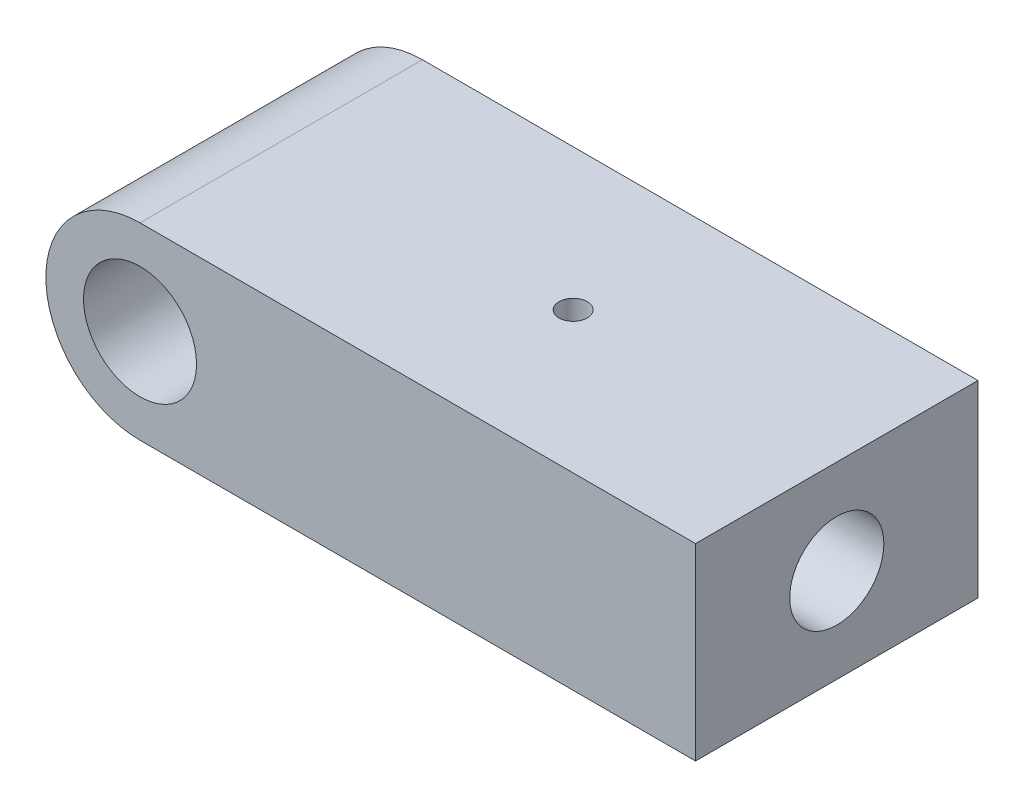
ISO-10303-21;
HEADER;
FILE_DESCRIPTION(('STEP AP214'),'2;1');
FILE_NAME('part.step','',(''),(''),'','','');
FILE_SCHEMA(('AUTOMOTIVE_DESIGN { 1 0 10303 214 1 1 1 1 }'));
ENDSEC;
DATA;
#1=APPLICATION_CONTEXT('core data for automotive mechanical design processes');
#2=APPLICATION_PROTOCOL_DEFINITION('international standard','automotive_design',2000,#1);
#3=PRODUCT_CONTEXT('',#1,'mechanical');
#4=PRODUCT('Part','Part','',(#3));
#5=PRODUCT_RELATED_PRODUCT_CATEGORY('part','',(#4));
#6=PRODUCT_DEFINITION_FORMATION('','',#4);
#7=PRODUCT_DEFINITION_CONTEXT('part definition',#1,'design');
#8=PRODUCT_DEFINITION('design','',#6,#7);
#9=PRODUCT_DEFINITION_SHAPE('','',#8);
#10=(LENGTH_UNIT() NAMED_UNIT(*) SI_UNIT(.MILLI.,.METRE.));
#11=(NAMED_UNIT(*) PLANE_ANGLE_UNIT() SI_UNIT($,.RADIAN.));
#12=(NAMED_UNIT(*) SI_UNIT($,.STERADIAN.) SOLID_ANGLE_UNIT());
#13=UNCERTAINTY_MEASURE_WITH_UNIT(LENGTH_MEASURE(1.E-05),#10,'distance_accuracy_value','');
#14=(GEOMETRIC_REPRESENTATION_CONTEXT(3) GLOBAL_UNCERTAINTY_ASSIGNED_CONTEXT((#13)) GLOBAL_UNIT_ASSIGNED_CONTEXT((#10,
#11,#12)) REPRESENTATION_CONTEXT('',''));
#15=CARTESIAN_POINT('',(0.,0.,0.));
#16=DIRECTION('',(0.,0.,1.));
#17=DIRECTION('',(1.,0.,0.));
#18=AXIS2_PLACEMENT_3D('',#15,#16,#17);
#19=CARTESIAN_POINT('',(0.,0.,15.));
#20=DIRECTION('',(0.,0.,1.));
#21=DIRECTION('',(1.,0.,0.));
#22=AXIS2_PLACEMENT_3D('',#19,#20,#21);
#23=PLANE('',#22);
#24=CARTESIAN_POINT('',(0.,0.,15.));
#25=DIRECTION('',(0.,0.,1.));
#26=DIRECTION('',(1.,0.,0.));
#27=AXIS2_PLACEMENT_3D('',#24,#25,#26);
#28=CIRCLE('',#27,10.);
#29=CARTESIAN_POINT('',(0.,10.,15.));
#30=VERTEX_POINT('',#29);
#31=CARTESIAN_POINT('',(0.,-10.,15.));
#32=VERTEX_POINT('',#31);
#33=EDGE_CURVE('E122',#30,#32,#28,.T.);
#34=ORIENTED_EDGE('',*,*,#33,.T.);
#35=DIRECTION('',(1.,0.,0.));
#36=VECTOR('',#35,1.);
#37=CARTESIAN_POINT('',(0.,-10.,15.));
#38=LINE('',#37,#36);
#39=CARTESIAN_POINT('',(59.,-10.,15.));
#40=VERTEX_POINT('',#39);
#41=EDGE_CURVE('E94',#32,#40,#38,.T.);
#42=ORIENTED_EDGE('',*,*,#41,.T.);
#43=DIRECTION('',(0.,1.,0.));
#44=VECTOR('',#43,1.);
#45=CARTESIAN_POINT('',(59.,10.,15.));
#46=LINE('',#45,#44);
#47=CARTESIAN_POINT('',(59.,10.,15.));
#48=VERTEX_POINT('',#47);
#49=EDGE_CURVE('E125',#40,#48,#46,.T.);
#50=ORIENTED_EDGE('',*,*,#49,.T.);
#51=DIRECTION('',(-1.,0.,0.));
#52=VECTOR('',#51,1.);
#53=CARTESIAN_POINT('',(0.,10.,15.));
#54=LINE('',#53,#52);
#55=EDGE_CURVE('E63',#48,#30,#54,.T.);
#56=ORIENTED_EDGE('',*,*,#55,.T.);
#57=EDGE_LOOP('',(#34,#42,#50,#56));
#58=FACE_BOUND('',#57,.T.);
#59=CARTESIAN_POINT('',(0.,0.,15.));
#60=DIRECTION('',(0.,0.,1.));
#61=DIRECTION('',(1.,0.,0.));
#62=AXIS2_PLACEMENT_3D('',#59,#60,#61);
#63=CIRCLE('',#62,6.);
#64=CARTESIAN_POINT('',(6.,0.,15.));
#65=VERTEX_POINT('',#64);
#66=EDGE_CURVE('E112',#65,#65,#63,.T.);
#67=ORIENTED_EDGE('',*,*,#66,.F.);
#68=EDGE_LOOP('',(#67));
#69=FACE_BOUND('',#68,.T.);
#70=ADVANCED_FACE('F40',(#58,#69),#23,.T.);
#71=CARTESIAN_POINT('',(0.,0.,-15.));
#72=DIRECTION('',(0.,0.,1.));
#73=DIRECTION('',(1.,0.,0.));
#74=AXIS2_PLACEMENT_3D('',#71,#72,#73);
#75=PLANE('',#74);
#76=CARTESIAN_POINT('',(0.,0.,-15.));
#77=DIRECTION('',(0.,0.,1.));
#78=DIRECTION('',(1.,0.,0.));
#79=AXIS2_PLACEMENT_3D('',#76,#77,#78);
#80=CIRCLE('',#79,10.);
#81=CARTESIAN_POINT('',(0.,10.,-15.));
#82=VERTEX_POINT('',#81);
#83=CARTESIAN_POINT('',(0.,-10.,-15.));
#84=VERTEX_POINT('',#83);
#85=EDGE_CURVE('E120',#82,#84,#80,.T.);
#86=ORIENTED_EDGE('',*,*,#85,.F.);
#87=DIRECTION('',(-1.,0.,0.));
#88=VECTOR('',#87,1.);
#89=CARTESIAN_POINT('',(0.,10.,-15.));
#90=LINE('',#89,#88);
#91=CARTESIAN_POINT('',(59.,10.,-15.));
#92=VERTEX_POINT('',#91);
#93=EDGE_CURVE('E87',#92,#82,#90,.T.);
#94=ORIENTED_EDGE('',*,*,#93,.F.);
#95=DIRECTION('',(0.,1.,0.));
#96=VECTOR('',#95,1.);
#97=CARTESIAN_POINT('',(59.,10.,-15.));
#98=LINE('',#97,#96);
#99=CARTESIAN_POINT('',(59.,-10.,-15.));
#100=VERTEX_POINT('',#99);
#101=EDGE_CURVE('E81',#100,#92,#98,.T.);
#102=ORIENTED_EDGE('',*,*,#101,.F.);
#103=DIRECTION('',(1.,0.,0.));
#104=VECTOR('',#103,1.);
#105=CARTESIAN_POINT('',(0.,-10.,-15.));
#106=LINE('',#105,#104);
#107=EDGE_CURVE('E131',#84,#100,#106,.T.);
#108=ORIENTED_EDGE('',*,*,#107,.F.);
#109=EDGE_LOOP('',(#86,#94,#102,#108));
#110=FACE_BOUND('',#109,.T.);
#111=CARTESIAN_POINT('',(0.,0.,-15.));
#112=DIRECTION('',(0.,0.,1.));
#113=DIRECTION('',(1.,0.,0.));
#114=AXIS2_PLACEMENT_3D('',#111,#112,#113);
#115=CIRCLE('',#114,6.);
#116=CARTESIAN_POINT('',(6.,0.,-15.));
#117=VERTEX_POINT('',#116);
#118=EDGE_CURVE('E108',#117,#117,#115,.T.);
#119=ORIENTED_EDGE('',*,*,#118,.T.);
#120=EDGE_LOOP('',(#119));
#121=FACE_BOUND('',#120,.T.);
#122=ADVANCED_FACE('F166',(#110,#121),#75,.F.);
#123=CARTESIAN_POINT('',(0.,0.,15.));
#124=DIRECTION('',(0.,0.,-1.));
#125=DIRECTION('',(-1.,0.,0.));
#126=AXIS2_PLACEMENT_3D('',#123,#124,#125);
#127=CYLINDRICAL_SURFACE('',#126,10.);
#128=ORIENTED_EDGE('',*,*,#85,.T.);
#129=DIRECTION('',(0.,0.,-1.));
#130=VECTOR('',#129,1.);
#131=CARTESIAN_POINT('',(0.,-10.,15.));
#132=LINE('',#131,#130);
#133=EDGE_CURVE('E11',#32,#84,#132,.T.);
#134=ORIENTED_EDGE('',*,*,#133,.F.);
#135=ORIENTED_EDGE('',*,*,#33,.F.);
#136=DIRECTION('',(0.,0.,-1.));
#137=VECTOR('',#136,1.);
#138=CARTESIAN_POINT('',(0.,10.,15.));
#139=LINE('',#138,#137);
#140=EDGE_CURVE('E128',#30,#82,#139,.T.);
#141=ORIENTED_EDGE('',*,*,#140,.T.);
#142=EDGE_LOOP('',(#128,#134,#135,#141));
#143=FACE_BOUND('',#142,.T.);
#144=ADVANCED_FACE('F42',(#143),#127,.T.);
#145=CARTESIAN_POINT('',(0.,-10.,15.));
#146=DIRECTION('',(0.,1.,0.));
#147=DIRECTION('',(0.,0.,1.));
#148=AXIS2_PLACEMENT_3D('',#145,#146,#147);
#149=PLANE('',#148);
#150=CARTESIAN_POINT('',(40.,-10.,0.));
#151=DIRECTION('',(0.,-1.,0.));
#152=DIRECTION('',(0.,0.,-1.));
#153=AXIS2_PLACEMENT_3D('',#150,#151,#152);
#154=CIRCLE('',#153,1.65);
#155=CARTESIAN_POINT('',(40.,-10.,-1.65));
#156=VERTEX_POINT('',#155);
#157=EDGE_CURVE('E192',#156,#156,#154,.T.);
#158=ORIENTED_EDGE('',*,*,#157,.F.);
#159=EDGE_LOOP('',(#158));
#160=FACE_BOUND('',#159,.T.);
#161=CARTESIAN_POINT('',(23.,-10.,0.));
#162=DIRECTION('',(0.,-1.,0.));
#163=DIRECTION('',(0.,0.,-1.));
#164=AXIS2_PLACEMENT_3D('',#161,#162,#163);
#165=CIRCLE('',#164,1.65);
#166=CARTESIAN_POINT('',(23.,-10.,-1.65));
#167=VERTEX_POINT('',#166);
#168=EDGE_CURVE('E195',#167,#167,#165,.T.);
#169=ORIENTED_EDGE('',*,*,#168,.F.);
#170=EDGE_LOOP('',(#169));
#171=FACE_BOUND('',#170,.T.);
#172=ORIENTED_EDGE('',*,*,#107,.T.);
#173=DIRECTION('',(0.,0.,-1.));
#174=VECTOR('',#173,1.);
#175=CARTESIAN_POINT('',(59.,-10.,15.));
#176=LINE('',#175,#174);
#177=EDGE_CURVE('E54',#40,#100,#176,.T.);
#178=ORIENTED_EDGE('',*,*,#177,.F.);
#179=ORIENTED_EDGE('',*,*,#41,.F.);
#180=ORIENTED_EDGE('',*,*,#133,.T.);
#181=EDGE_LOOP('',(#172,#178,#179,#180));
#182=FACE_BOUND('',#181,.T.);
#183=ADVANCED_FACE('F182',(#160,#171,#182),#149,.F.);
#184=CARTESIAN_POINT('',(59.,10.,15.));
#185=DIRECTION('',(-1.,0.,0.));
#186=DIRECTION('',(0.,0.,1.));
#187=AXIS2_PLACEMENT_3D('',#184,#185,#186);
#188=PLANE('',#187);
#189=CARTESIAN_POINT('',(59.,0.,0.));
#190=DIRECTION('',(1.,0.,0.));
#191=DIRECTION('',(0.,0.,-1.));
#192=AXIS2_PLACEMENT_3D('',#189,#190,#191);
#193=CIRCLE('',#192,5.);
#194=CARTESIAN_POINT('',(59.,0.,-5.));
#195=VERTEX_POINT('',#194);
#196=EDGE_CURVE('E109',#195,#195,#193,.T.);
#197=ORIENTED_EDGE('',*,*,#196,.F.);
#198=EDGE_LOOP('',(#197));
#199=FACE_BOUND('',#198,.T.);
#200=ORIENTED_EDGE('',*,*,#101,.T.);
#201=DIRECTION('',(0.,0.,-1.));
#202=VECTOR('',#201,1.);
#203=CARTESIAN_POINT('',(59.,10.,15.));
#204=LINE('',#203,#202);
#205=EDGE_CURVE('E136',#48,#92,#204,.T.);
#206=ORIENTED_EDGE('',*,*,#205,.F.);
#207=ORIENTED_EDGE('',*,*,#49,.F.);
#208=ORIENTED_EDGE('',*,*,#177,.T.);
#209=EDGE_LOOP('',(#200,#206,#207,#208));
#210=FACE_BOUND('',#209,.T.);
#211=ADVANCED_FACE('F179',(#199,#210),#188,.F.);
#212=CARTESIAN_POINT('',(0.,10.,15.));
#213=DIRECTION('',(0.,-1.,0.));
#214=DIRECTION('',(0.,0.,-1.));
#215=AXIS2_PLACEMENT_3D('',#212,#213,#214);
#216=PLANE('',#215);
#217=CARTESIAN_POINT('',(31.,10.,0.));
#218=DIRECTION('',(0.,1.,0.));
#219=DIRECTION('',(0.,0.,1.));
#220=AXIS2_PLACEMENT_3D('',#217,#218,#219);
#221=CIRCLE('',#220,1.49999999999999);
#222=CARTESIAN_POINT('',(31.,10.,1.49999999999999));
#223=VERTEX_POINT('',#222);
#224=EDGE_CURVE('E143',#223,#223,#221,.T.);
#225=ORIENTED_EDGE('',*,*,#224,.F.);
#226=EDGE_LOOP('',(#225));
#227=FACE_BOUND('',#226,.T.);
#228=ORIENTED_EDGE('',*,*,#93,.T.);
#229=ORIENTED_EDGE('',*,*,#140,.F.);
#230=ORIENTED_EDGE('',*,*,#55,.F.);
#231=ORIENTED_EDGE('',*,*,#205,.T.);
#232=EDGE_LOOP('',(#228,#229,#230,#231));
#233=FACE_BOUND('',#232,.T.);
#234=ADVANCED_FACE('F176',(#227,#233),#216,.F.);
#235=CARTESIAN_POINT('',(0.,0.,15.));
#236=DIRECTION('',(0.,0.,-1.));
#237=DIRECTION('',(-1.,0.,0.));
#238=AXIS2_PLACEMENT_3D('',#235,#236,#237);
#239=CYLINDRICAL_SURFACE('',#238,6.);
#240=ORIENTED_EDGE('',*,*,#66,.T.);
#241=EDGE_LOOP('',(#240));
#242=FACE_BOUND('',#241,.T.);
#243=ORIENTED_EDGE('',*,*,#118,.F.);
#244=EDGE_LOOP('',(#243));
#245=FACE_BOUND('',#244,.T.);
#246=ADVANCED_FACE('F102',(#242,#245),#239,.F.);
#247=CARTESIAN_POINT('',(19.,0.,0.));
#248=DIRECTION('',(1.,0.,0.));
#249=DIRECTION('',(0.,0.,-1.));
#250=AXIS2_PLACEMENT_3D('',#247,#248,#249);
#251=CONICAL_SURFACE('',#250,4.99999999999999,1.02974425867665);
#252=CARTESIAN_POINT('',(15.9956969048622,0.,0.));
#253=VERTEX_POINT('',#252);
#254=VERTEX_LOOP('',#253);
#255=FACE_BOUND('',#254,.T.);
#256=CARTESIAN_POINT('',(19.,0.,0.));
#257=DIRECTION('',(1.,0.,0.));
#258=DIRECTION('',(0.,0.,-1.));
#259=AXIS2_PLACEMENT_3D('',#256,#257,#258);
#260=CIRCLE('',#259,4.99999999999999);
#261=CARTESIAN_POINT('',(19.,0.,-4.99999999999999));
#262=VERTEX_POINT('',#261);
#263=EDGE_CURVE('E106',#262,#262,#260,.T.);
#264=ORIENTED_EDGE('',*,*,#263,.T.);
#265=EDGE_LOOP('',(#264));
#266=FACE_BOUND('',#265,.T.);
#267=ADVANCED_FACE('F98',(#255,#266),#251,.F.);
#268=CARTESIAN_POINT('',(59.,0.,0.));
#269=DIRECTION('',(1.,0.,0.));
#270=DIRECTION('',(0.,0.,-1.));
#271=AXIS2_PLACEMENT_3D('',#268,#269,#270);
#272=CYLINDRICAL_SURFACE('',#271,4.99999999999999);
#273=CARTESIAN_POINT('',(40.,-4.71990466005405,-1.65));
#274=CARTESIAN_POINT('',(40.0899293992906,-4.71990452115882,-1.65000024360504));
#275=CARTESIAN_POINT('',(40.1798576864997,-4.72250292266518,-1.64262303818655));
#276=CARTESIAN_POINT('',(40.3570536734352,-4.73256311651637,-1.61340616817484));
#277=CARTESIAN_POINT('',(40.4443208874604,-4.74002579119602,-1.59156387973589));
#278=CARTESIAN_POINT('',(40.6135996993791,-4.75887919770346,-1.53426465819808));
#279=CARTESIAN_POINT('',(40.6956210776635,-4.77026235105613,-1.49883397722407));
#280=CARTESIAN_POINT('',(40.8525814963571,-4.79566317693292,-1.41545303535855));
#281=CARTESIAN_POINT('',(40.9275190184637,-4.80968141232601,-1.36750009878646));
#282=CARTESIAN_POINT('',(41.0710576393882,-4.83937566103106,-1.25846654308765));
#283=CARTESIAN_POINT('',(41.1393474857335,-4.85509238793418,-1.1969871597991));
#284=CARTESIAN_POINT('',(41.2648592676789,-4.8860682262247,-1.06349727663171));
#285=CARTESIAN_POINT('',(41.322079465466,-4.90132726544298,-0.991485126335475));
#286=CARTESIAN_POINT('',(41.4252335890228,-4.93013890958223,-0.836704215602397));
#287=CARTESIAN_POINT('',(41.4708423064067,-4.94363804307573,-0.753707887278361));
#288=CARTESIAN_POINT('',(41.5473287348498,-4.96692987406679,-0.580699685040881));
#289=CARTESIAN_POINT('',(41.5782103320565,-4.9767235492083,-0.490689669179499));
#290=CARTESIAN_POINT('',(41.6233130718751,-4.99121262924257,-0.309471831071053));
#291=CARTESIAN_POINT('',(41.6380672149885,-4.99607073696452,-0.218409916306841));
#292=CARTESIAN_POINT('',(41.6521899987148,-5.00071837425093,-0.0349820134684132));
#293=CARTESIAN_POINT('',(41.6515625278461,-5.00050918484353,0.0573836391159495));
#294=CARTESIAN_POINT('',(41.6352800254569,-4.99515654976728,0.237027933093926));
#295=CARTESIAN_POINT('',(41.6202037350628,-4.99020313675408,0.32436561595269));
#296=CARTESIAN_POINT('',(41.5764073968143,-4.97615641573889,0.495193577669013));
#297=CARTESIAN_POINT('',(41.5476864291757,-4.96706282865058,0.578683596740286));
#298=CARTESIAN_POINT('',(41.4770726219358,-4.94551338736031,0.740723104693064));
#299=CARTESIAN_POINT('',(41.4350133157426,-4.93301533884173,0.819194207586597));
#300=CARTESIAN_POINT('',(41.3390533249613,-4.90596050876767,0.96813740001638));
#301=CARTESIAN_POINT('',(41.2851493942767,-4.89140316323875,1.03860728872218));
#302=CARTESIAN_POINT('',(41.1641048235328,-4.86097294536878,1.1729917525873));
#303=CARTESIAN_POINT('',(41.0964676942656,-4.84507036749806,1.23645304594368));
#304=CARTESIAN_POINT('',(40.9513734103644,-4.81431124792122,1.35127700383062));
#305=CARTESIAN_POINT('',(40.8739148069588,-4.79945486104326,1.4026378802203));
#306=CARTESIAN_POINT('',(40.7099656011424,-4.77230967313122,1.49241382326107));
#307=CARTESIAN_POINT('',(40.6233656123386,-4.76005891661914,1.5306415054313));
#308=CARTESIAN_POINT('',(40.4444523928425,-4.73995346804781,1.59181981773764));
#309=CARTESIAN_POINT('',(40.3521415165417,-4.73209697762927,1.61477669819906));
#310=CARTESIAN_POINT('',(40.1688098323007,-4.72207527963096,1.64384682592321));
#311=CARTESIAN_POINT('',(40.0779131556508,-4.71967327795614,1.6506614560171));
#312=CARTESIAN_POINT('',(39.8962621521121,-4.72017136658519,1.64923749492087));
#313=CARTESIAN_POINT('',(39.8055078028708,-4.72307051828914,1.64100156851918));
#314=CARTESIAN_POINT('',(39.6298799277633,-4.73360855675224,1.61033997123775));
#315=CARTESIAN_POINT('',(39.5449112306032,-4.74108573426459,1.58839792719591));
#316=CARTESIAN_POINT('',(39.3798773929833,-4.75976051805481,1.53152522846697));
#317=CARTESIAN_POINT('',(39.2998131136739,-4.77095877549974,1.49659230032422));
#318=CARTESIAN_POINT('',(39.1440899729592,-4.7962472689917,1.41348842564755));
#319=CARTESIAN_POINT('',(39.0686468309744,-4.81041691149476,1.36493806698654));
#320=CARTESIAN_POINT('',(38.9267243962533,-4.83989585604411,1.25640957990472));
#321=CARTESIAN_POINT('',(38.8602477046731,-4.85520548680902,1.19642814746825));
#322=CARTESIAN_POINT('',(38.7349168192165,-4.88610989384611,1.06339123842035));
#323=CARTESIAN_POINT('',(38.6765677610735,-4.9016842503764,0.989853763923047));
#324=CARTESIAN_POINT('',(38.5730073584089,-4.93065204495411,0.833649177353402));
#325=CARTESIAN_POINT('',(38.5277955209475,-4.94404556482343,0.750982407994639));
#326=CARTESIAN_POINT('',(38.4522110077412,-4.96707750850082,0.579295715379797));
#327=CARTESIAN_POINT('',(38.4217395412565,-4.97674084137499,0.490322802958603));
#328=CARTESIAN_POINT('',(38.3763133068077,-4.99133146825928,0.308134735858255));
#329=CARTESIAN_POINT('',(38.3613530615347,-4.99626043401973,0.214921090808603));
#330=CARTESIAN_POINT('',(38.3478591821431,-5.00070328980922,0.0315225864698998));
#331=CARTESIAN_POINT('',(38.3485996879108,-5.00045646732493,-0.0586036580668706));
#332=CARTESIAN_POINT('',(38.3647015242736,-4.99516201889142,-0.237388028290533));
#333=CARTESIAN_POINT('',(38.3800617082897,-4.99011476942582,-0.326046268553992));
#334=CARTESIAN_POINT('',(38.4244883059242,-4.97587240449465,-0.498029665785519));
#335=CARTESIAN_POINT('',(38.4533413349192,-4.96674195827475,-0.58141568037716));
#336=CARTESIAN_POINT('',(38.5237378947814,-4.94527347683186,-0.742196807428923));
#337=CARTESIAN_POINT('',(38.5652837051194,-4.93293486552037,-0.819590840669551));
#338=CARTESIAN_POINT('',(38.6616326539251,-4.9057637494671,-0.969268380933022));
#339=CARTESIAN_POINT('',(38.7168641480969,-4.89085668492739,-1.04126244269286));
#340=CARTESIAN_POINT('',(38.8382836506441,-4.86041514438606,-1.17519818555166));
#341=CARTESIAN_POINT('',(38.9044751192978,-4.84488047141096,-1.23713667964079));
#342=CARTESIAN_POINT('',(39.0489558514546,-4.81423121094682,-1.35160179814247));
#343=CARTESIAN_POINT('',(39.1276102694892,-4.79915525016868,-1.4036792928643));
#344=CARTESIAN_POINT('',(39.2930216621242,-4.77186368687928,-1.49383628223878));
#345=CARTESIAN_POINT('',(39.3797763128349,-4.75964726749499,-1.53191977627391));
#346=CARTESIAN_POINT('',(39.5543432724432,-4.74014636717987,-1.59120734764471));
#347=CARTESIAN_POINT('',(39.6418680419352,-4.73263920267759,-1.61318355190477));
#348=CARTESIAN_POINT('',(39.8195961712927,-4.72251921935149,-1.64257737451179));
#349=CARTESIAN_POINT('',(39.9097986450552,-4.71990479936931,-1.64999975565828));
#350=CARTESIAN_POINT('',(40.,-4.71990466005405,-1.65));
#351=B_SPLINE_CURVE_WITH_KNOTS('',3,(#273,#274,#275,#276,#277,#278,#279,#280,#281,#282,#283,
#284,#285,#286,#287,#288,#289,#290,#291,#292,#293,#294,#295,#296,#297,#298,#299,#300,#301,#302,
#303,#304,#305,#306,#307,#308,#309,#310,#311,#312,#313,#314,#315,#316,#317,#318,#319,#320,#321,
#322,#323,#324,#325,#326,#327,#328,#329,#330,#331,#332,#333,#334,#335,#336,#337,#338,#339,#340,
#341,#342,#343,#344,#345,#346,#347,#348,#349,#350),.UNSPECIFIED.,.T.,.F.,(4,2,2,2,2,2,2,2,2,2,2,
2,2,2,2,2,2,2,2,2,2,2,2,2,2,2,2,2,2,2,2,2,2,2,2,2,2,2,4),(0.,0.269454302916432,
0.538957495994028,0.807942623457635,1.07698527314817,1.3553904348317,1.63383926765626,
1.91939248597708,2.2048703116341,2.48059787689522,2.75625573811558,3.02131448573184,
3.2863911034247,3.55491555402299,3.82351368748603,4.10452131305698,4.38557043856028,
4.67047751353534,4.95526790443248,5.22743703243198,5.49955797597573,5.76258081799806,
6.02564971172707,6.29693565916084,6.56830013781585,6.85241935986189,7.13652791970021,
7.41870503995781,7.70078248410447,7.96984890311455,8.23889422176276,8.50382155957889,
8.76879650315115,9.04343817678384,9.31816672608184,9.60337461850678,9.88850093710114,
10.1588585876967,10.4291277478431),.UNSPECIFIED.);
#352=CARTESIAN_POINT('',(40.,-4.71990466005405,-1.65));
#353=VERTEX_POINT('',#352);
#354=EDGE_CURVE('E44',#353,#353,#351,.T.);
#355=ORIENTED_EDGE('',*,*,#354,.T.);
#356=EDGE_LOOP('',(#355));
#357=FACE_BOUND('',#356,.T.);
#358=CARTESIAN_POINT('',(23.,-4.71990466005405,-1.65));
#359=CARTESIAN_POINT('',(23.0899293992906,-4.71990452115882,-1.65000024360504));
#360=CARTESIAN_POINT('',(23.1798576864997,-4.72250292266518,-1.64262303818655));
#361=CARTESIAN_POINT('',(23.3570536734352,-4.73256311651637,-1.61340616817484));
#362=CARTESIAN_POINT('',(23.4443208874604,-4.74002579119602,-1.59156387973589));
#363=CARTESIAN_POINT('',(23.6135996993791,-4.75887919770346,-1.53426465819808));
#364=CARTESIAN_POINT('',(23.6956210776635,-4.77026235105613,-1.49883397722407));
#365=CARTESIAN_POINT('',(23.8525814963571,-4.79566317693292,-1.41545303535855));
#366=CARTESIAN_POINT('',(23.9275190184637,-4.80968141232601,-1.36750009878647));
#367=CARTESIAN_POINT('',(24.0710576393882,-4.83937566103106,-1.25846654308765));
#368=CARTESIAN_POINT('',(24.1393474857335,-4.85509238793418,-1.1969871597991));
#369=CARTESIAN_POINT('',(24.2648592676789,-4.8860682262247,-1.06349727663172));
#370=CARTESIAN_POINT('',(24.322079465466,-4.90132726544298,-0.991485126335478));
#371=CARTESIAN_POINT('',(24.4252335890228,-4.93013890958223,-0.836704215602401));
#372=CARTESIAN_POINT('',(24.4708423064067,-4.94363804307573,-0.753707887278364));
#373=CARTESIAN_POINT('',(24.5473287348498,-4.96692987406679,-0.580699685040886));
#374=CARTESIAN_POINT('',(24.5782103320565,-4.9767235492083,-0.490689669179505));
#375=CARTESIAN_POINT('',(24.6233130718751,-4.99121262924257,-0.309471831071059));
#376=CARTESIAN_POINT('',(24.6380672149885,-4.99607073696452,-0.218409916306846));
#377=CARTESIAN_POINT('',(24.6521899987148,-5.00071837425093,-0.0349820134684164));
#378=CARTESIAN_POINT('',(24.6515625278461,-5.00050918484353,0.0573836391159468));
#379=CARTESIAN_POINT('',(24.6352800254568,-4.99515654976728,0.237027933093924));
#380=CARTESIAN_POINT('',(24.6202037350628,-4.99020313675408,0.324365615952688));
#381=CARTESIAN_POINT('',(24.5764073968143,-4.97615641573889,0.49519357766901));
#382=CARTESIAN_POINT('',(24.5476864291757,-4.96706282865058,0.578683596740283));
#383=CARTESIAN_POINT('',(24.4770726219358,-4.94551338736031,0.740723104693062));
#384=CARTESIAN_POINT('',(24.4350133157426,-4.93301533884173,0.819194207586596));
#385=CARTESIAN_POINT('',(24.3390533249613,-4.90596050876767,0.968137400016379));
#386=CARTESIAN_POINT('',(24.2851493942767,-4.89140316323875,1.03860728872218));
#387=CARTESIAN_POINT('',(24.1641048235328,-4.86097294536878,1.1729917525873));
#388=CARTESIAN_POINT('',(24.0964676942656,-4.84507036749806,1.23645304594368));
#389=CARTESIAN_POINT('',(23.9513734103644,-4.81431124792122,1.35127700383062));
#390=CARTESIAN_POINT('',(23.8739148069588,-4.79945486104326,1.4026378802203));
#391=CARTESIAN_POINT('',(23.7099656011424,-4.77230967313122,1.49241382326107));
#392=CARTESIAN_POINT('',(23.6233656123386,-4.76005891661914,1.5306415054313));
#393=CARTESIAN_POINT('',(23.4444523928425,-4.73995346804781,1.59181981773764));
#394=CARTESIAN_POINT('',(23.3521415165417,-4.73209697762927,1.61477669819906));
#395=CARTESIAN_POINT('',(23.1688098323007,-4.72207527963096,1.64384682592321));
#396=CARTESIAN_POINT('',(23.0779131556508,-4.71967327795614,1.6506614560171));
#397=CARTESIAN_POINT('',(22.8962621521121,-4.72017136658519,1.64923749492087));
#398=CARTESIAN_POINT('',(22.8055078028708,-4.72307051828914,1.64100156851918));
#399=CARTESIAN_POINT('',(22.6298799277633,-4.73360855675224,1.61033997123775));
#400=CARTESIAN_POINT('',(22.5449112306032,-4.74108573426459,1.58839792719591));
#401=CARTESIAN_POINT('',(22.3798773929833,-4.75976051805481,1.53152522846697));
#402=CARTESIAN_POINT('',(22.2998131136739,-4.77095877549974,1.49659230032422));
#403=CARTESIAN_POINT('',(22.1440899729592,-4.7962472689917,1.41348842564755));
#404=CARTESIAN_POINT('',(22.0686468309744,-4.81041691149476,1.36493806698655));
#405=CARTESIAN_POINT('',(21.9267243962533,-4.83989585604411,1.25640957990473));
#406=CARTESIAN_POINT('',(21.8602477046731,-4.85520548680902,1.19642814746825));
#407=CARTESIAN_POINT('',(21.7349168192165,-4.88610989384611,1.06339123842035));
#408=CARTESIAN_POINT('',(21.6765677610735,-4.9016842503764,0.98985376392305));
#409=CARTESIAN_POINT('',(21.5730073584089,-4.93065204495411,0.833649177353404));
#410=CARTESIAN_POINT('',(21.5277955209475,-4.94404556482343,0.750982407994641));
#411=CARTESIAN_POINT('',(21.4522110077412,-4.96707750850082,0.579295715379799));
#412=CARTESIAN_POINT('',(21.4217395412565,-4.97674084137499,0.490322802958604));
#413=CARTESIAN_POINT('',(21.3763133068077,-4.99133146825928,0.308134735858256));
#414=CARTESIAN_POINT('',(21.3613530615348,-4.99626043401973,0.214921090808604));
#415=CARTESIAN_POINT('',(21.3478591821431,-5.00070328980922,0.0315225864699016));
#416=CARTESIAN_POINT('',(21.3485996879108,-5.00045646732493,-0.0586036580668689));
#417=CARTESIAN_POINT('',(21.3647015242736,-4.99516201889142,-0.23738802829053));
#418=CARTESIAN_POINT('',(21.3800617082897,-4.99011476942582,-0.326046268553989));
#419=CARTESIAN_POINT('',(21.4244883059242,-4.97587240449465,-0.498029665785516));
#420=CARTESIAN_POINT('',(21.4533413349192,-4.96674195827475,-0.581415680377157));
#421=CARTESIAN_POINT('',(21.5237378947814,-4.94527347683186,-0.74219680742892));
#422=CARTESIAN_POINT('',(21.5652837051194,-4.93293486552037,-0.819590840669547));
#423=CARTESIAN_POINT('',(21.6616326539251,-4.9057637494671,-0.969268380933019));
#424=CARTESIAN_POINT('',(21.7168641480969,-4.89085668492739,-1.04126244269286));
#425=CARTESIAN_POINT('',(21.8382836506441,-4.86041514438606,-1.17519818555166));
#426=CARTESIAN_POINT('',(21.9044751192978,-4.84488047141096,-1.23713667964079));
#427=CARTESIAN_POINT('',(22.0489558514546,-4.81423121094682,-1.35160179814246));
#428=CARTESIAN_POINT('',(22.1276102694892,-4.79915525016868,-1.40367929286429));
#429=CARTESIAN_POINT('',(22.2930216621242,-4.77186368687929,-1.49383628223878));
#430=CARTESIAN_POINT('',(22.3797763128349,-4.75964726749499,-1.5319197762739));
#431=CARTESIAN_POINT('',(22.5543432724432,-4.74014636717988,-1.59120734764471));
#432=CARTESIAN_POINT('',(22.6418680419352,-4.73263920267759,-1.61318355190477));
#433=CARTESIAN_POINT('',(22.8195961712927,-4.72251921935149,-1.64257737451179));
#434=CARTESIAN_POINT('',(22.9097986450553,-4.71990479936931,-1.64999975565828));
#435=CARTESIAN_POINT('',(23.,-4.71990466005405,-1.65));
#436=B_SPLINE_CURVE_WITH_KNOTS('',3,(#358,#359,#360,#361,#362,#363,#364,#365,#366,#367,#368,
#369,#370,#371,#372,#373,#374,#375,#376,#377,#378,#379,#380,#381,#382,#383,#384,#385,#386,#387,
#388,#389,#390,#391,#392,#393,#394,#395,#396,#397,#398,#399,#400,#401,#402,#403,#404,#405,#406,
#407,#408,#409,#410,#411,#412,#413,#414,#415,#416,#417,#418,#419,#420,#421,#422,#423,#424,#425,
#426,#427,#428,#429,#430,#431,#432,#433,#434,#435),.UNSPECIFIED.,.T.,.F.,(4,2,2,2,2,2,2,2,2,2,2,
2,2,2,2,2,2,2,2,2,2,2,2,2,2,2,2,2,2,2,2,2,2,2,2,2,2,2,4),(0.,0.269454302916436,
0.538957495994024,0.807942623457628,1.07698527314817,1.3553904348317,1.63383926765626,
1.91939248597707,2.2048703116341,2.48059787689522,2.75625573811558,3.02131448573183,
3.2863911034247,3.55491555402299,3.82351368748603,4.10452131305698,4.38557043856028,
4.67047751353534,4.95526790443248,5.22743703243198,5.49955797597572,5.76258081799806,
6.02564971172706,6.29693565916083,6.56830013781585,6.85241935986189,7.1365279197002,
7.4187050399578,7.70078248410447,7.96984890311455,8.23889422176275,8.50382155957889,
8.76879650315115,9.04343817678384,9.31816672608183,9.60337461850677,9.88850093710114,
10.1588585876967,10.4291277478431),.UNSPECIFIED.);
#437=CARTESIAN_POINT('',(23.,-4.71990466005405,-1.65));
#438=VERTEX_POINT('',#437);
#439=EDGE_CURVE('E144',#438,#438,#436,.T.);
#440=ORIENTED_EDGE('',*,*,#439,.T.);
#441=EDGE_LOOP('',(#440));
#442=FACE_BOUND('',#441,.T.);
#443=CARTESIAN_POINT('',(31.,4.76969600708472,1.49999999999999));
#444=CARTESIAN_POINT('',(31.0821945479424,4.76969685726979,1.49999897633763));
#445=CARTESIAN_POINT('',(31.164399224144,4.77184390209068,1.49322108167141));
#446=CARTESIAN_POINT('',(31.3264052495919,4.78016578302899,1.46635844446748));
#447=CARTESIAN_POINT('',(31.4062057865015,4.78634196493467,1.44626925573577));
#448=CARTESIAN_POINT('',(31.5610347282717,4.80196102485632,1.39352753269954));
#449=CARTESIAN_POINT('',(31.6360708296331,4.81139846703232,1.36089589394242));
#450=CARTESIAN_POINT('',(31.7796219339953,4.83246932547567,1.28406421917928));
#451=CARTESIAN_POINT('',(31.8481359586844,4.84410307041019,1.23986245137052));
#452=CARTESIAN_POINT('',(31.9788663905774,4.86866862185765,1.13964754141626));
#453=CARTESIAN_POINT('',(32.0408458979463,4.88162808311635,1.08333207175806));
#454=CARTESIAN_POINT('',(32.1546379513225,4.90714861936756,0.961136237579588));
#455=CARTESIAN_POINT('',(32.2064491904499,4.91970964297704,0.895254645461102));
#456=CARTESIAN_POINT('',(32.2994626998333,4.94333214579388,0.754111437793683));
#457=CARTESIAN_POINT('',(32.3404234244428,4.95435724342404,0.678684021335808));
#458=CARTESIAN_POINT('',(32.4089872590427,4.97334435920684,0.52162464536935));
#459=CARTESIAN_POINT('',(32.4365932498574,4.98130703789495,0.43999402838791));
#460=CARTESIAN_POINT('',(32.4768800010905,4.99307646003589,0.27532385263083));
#461=CARTESIAN_POINT('',(32.4899651276527,4.99699557369338,0.192391398953801));
#462=CARTESIAN_POINT('',(32.5021173246464,5.00063201501347,0.0254218237493157));
#463=CARTESIAN_POINT('',(32.501187339402,5.00035022521078,-0.0586150620503671));
#464=CARTESIAN_POINT('',(32.485607131457,4.99569603817658,-0.222571156600158));
#465=CARTESIAN_POINT('',(32.4713948061901,4.9914542020526,-0.302536267641339));
#466=CARTESIAN_POINT('',(32.4303686640057,4.97951522112592,-0.458889213442523));
#467=CARTESIAN_POINT('',(32.4035540490573,4.97181785750585,-0.535276821322842));
#468=CARTESIAN_POINT('',(32.3377879765814,4.95365220986963,-0.683347326351276));
#469=CARTESIAN_POINT('',(32.2986987971927,4.94315269676705,-0.754965064694473));
#470=CARTESIAN_POINT('',(32.2096021475718,4.92049640648068,-0.890764673783151));
#471=CARTESIAN_POINT('',(32.1595920870365,4.90833923637777,-0.954944774872126));
#472=CARTESIAN_POINT('',(32.0478022492484,4.88311550488165,-1.07666048152979));
#473=CARTESIAN_POINT('',(31.9856430809703,4.8700319532146,-1.13384458040111));
#474=CARTESIAN_POINT('',(31.8524899821099,4.84483979887496,-1.23707651539823));
#475=CARTESIAN_POINT('',(31.7814951746108,4.83273129317019,-1.28312324482852));
#476=CARTESIAN_POINT('',(31.631760530751,4.81077903197677,-1.36313995335449));
#477=CARTESIAN_POINT('',(31.5529529541371,4.80095810695956,-1.39698989237678));
#478=CARTESIAN_POINT('',(31.3903927915545,4.78496392548436,-1.45083362878412));
#479=CARTESIAN_POINT('',(31.3066418284654,4.77878947915829,-1.47083194640559));
#480=CARTESIAN_POINT('',(31.1399176392607,4.77104849541241,-1.49574770282164));
#481=CARTESIAN_POINT('',(31.057031776106,4.7693187867044,-1.50119946380211));
#482=CARTESIAN_POINT('',(30.8915270999901,4.77021192441923,-1.49835947233061));
#483=CARTESIAN_POINT('',(30.8089082512692,4.77283416156589,-1.49006964371329));
#484=CARTESIAN_POINT('',(30.6485116220291,4.78197558554912,-1.46045763574189));
#485=CARTESIAN_POINT('',(30.5706638357365,4.78839176507488,-1.43947961431279));
#486=CARTESIAN_POINT('',(30.4195983091851,4.80429141231227,-1.38548577747939));
#487=CARTESIAN_POINT('',(30.3463812858594,4.81377535359073,-1.35246810342759));
#488=CARTESIAN_POINT('',(30.2044825359279,4.83505835023047,-1.274318711965));
#489=CARTESIAN_POINT('',(30.1359752790142,4.84691271069798,-1.22888564172728));
#490=CARTESIAN_POINT('',(30.0073618938192,4.87148205646987,-1.12755301600384));
#491=CARTESIAN_POINT('',(29.9472577823872,4.88419724730003,-1.07165095534896));
#492=CARTESIAN_POINT('',(29.8348195941853,4.90963633548157,-0.948455132493592));
#493=CARTESIAN_POINT('',(29.782864371013,4.92234245063003,-0.880811065857429));
#494=CARTESIAN_POINT('',(29.6910332989723,4.9458485174865,-0.737461784590244));
#495=CARTESIAN_POINT('',(29.6511568502185,4.95664856384716,-0.661756970543939));
#496=CARTESIAN_POINT('',(29.5849999694317,4.97505970474957,-0.504935504705217));
#497=CARTESIAN_POINT('',(29.558617983841,4.98269453424965,-0.423864622037835));
#498=CARTESIAN_POINT('',(29.5199390811096,4.99401979596826,-0.258169966504586));
#499=CARTESIAN_POINT('',(29.5076381340516,4.99771135670879,-0.173547217354762));
#500=CARTESIAN_POINT('',(29.4977769559455,5.00066544081399,-0.00665215388274318));
#501=CARTESIAN_POINT('',(29.4996673045922,5.00009305111321,0.0755851790862057));
#502=CARTESIAN_POINT('',(29.5168216324991,4.99497264465036,0.238519481164402));
#503=CARTESIAN_POINT('',(29.5320848534804,4.99042485330462,0.319216537346526));
#504=CARTESIAN_POINT('',(29.5752116613996,4.97791168358326,0.475935813041354));
#505=CARTESIAN_POINT('',(29.602938180649,4.96998352900865,0.551998927351387));
#506=CARTESIAN_POINT('',(29.6700819145072,4.95152943039449,0.698433237752048));
#507=CARTESIAN_POINT('',(29.7095010502862,4.94100305949946,0.768803496050574));
#508=CARTESIAN_POINT('',(29.80037345743,4.91803965828228,0.904301892420557));
#509=CARTESIAN_POINT('',(29.8521714300008,4.90555226923559,0.96919025007676));
#510=CARTESIAN_POINT('',(29.9657103883328,4.88023537212333,1.08953757134594));
#511=CARTESIAN_POINT('',(30.0274542378982,4.86740576641079,1.14499380960193));
#512=CARTESIAN_POINT('',(30.1613407783105,4.84240680631319,1.24656269394548));
#513=CARTESIAN_POINT('',(30.2337385533904,4.83026852693485,1.29234759757955));
#514=CARTESIAN_POINT('',(30.385555174161,4.80852547508792,1.37104313528775));
#515=CARTESIAN_POINT('',(30.4649706236012,4.79891948596955,1.40395995557288));
#516=CARTESIAN_POINT('',(30.6197404316063,4.78427816717594,1.45301942532949));
#517=CARTESIAN_POINT('',(30.694608646931,4.77886154840519,1.47058859011231));
#518=CARTESIAN_POINT('',(30.8463152224958,4.77157042597166,1.49407818835143));
#519=CARTESIAN_POINT('',(30.9231531846452,4.7696952122143,1.50000095706094));
#520=CARTESIAN_POINT('',(31.,4.76969600708472,1.49999999999999));
#521=B_SPLINE_CURVE_WITH_KNOTS('',3,(#443,#444,#445,#446,#447,#448,#449,#450,#451,#452,#453,
#454,#455,#456,#457,#458,#459,#460,#461,#462,#463,#464,#465,#466,#467,#468,#469,#470,#471,#472,
#473,#474,#475,#476,#477,#478,#479,#480,#481,#482,#483,#484,#485,#486,#487,#488,#489,#490,#491,
#492,#493,#494,#495,#496,#497,#498,#499,#500,#501,#502,#503,#504,#505,#506,#507,#508,#509,#510,
#511,#512,#513,#514,#515,#516,#517,#518,#519,#520),.UNSPECIFIED.,.T.,.F.,(4,2,2,2,2,2,2,2,2,2,2,
2,2,2,2,2,2,2,2,2,2,2,2,2,2,2,2,2,2,2,2,2,2,2,2,2,2,2,4),(0.,0.246300165915542,
0.492682641688997,0.738656414466195,0.984667025370094,1.23773150007984,1.49082847871272,
1.74915939273644,2.00743455587876,2.25832140149556,2.50915554101439,2.75200125990878,
2.99486235890374,3.24055209335674,3.48630016590828,3.74152147023276,3.9967681249186,
4.25446238246264,4.51207250628408,4.76008080790306,5.00805439107385,5.24958594938814,
5.49115481045784,5.73920731809385,5.98731925928919,6.24479506100598,6.50225807324198,
6.75775391814321,7.01317662321678,7.25876303911216,7.5043355304775,7.74727096872214,
7.99024634491373,8.24099627054483,8.49181852629885,8.75011639669142,9.00828993963939,
9.23861153857441,9.46888695033554),.UNSPECIFIED.);
#522=CARTESIAN_POINT('',(31.,4.76969600708472,1.49999999999999));
#523=VERTEX_POINT('',#522);
#524=EDGE_CURVE('E115',#523,#523,#521,.T.);
#525=ORIENTED_EDGE('',*,*,#524,.T.);
#526=EDGE_LOOP('',(#525));
#527=FACE_BOUND('',#526,.T.);
#528=ORIENTED_EDGE('',*,*,#263,.F.);
#529=EDGE_LOOP('',(#528));
#530=FACE_BOUND('',#529,.T.);
#531=ORIENTED_EDGE('',*,*,#196,.T.);
#532=EDGE_LOOP('',(#531));
#533=FACE_BOUND('',#532,.T.);
#534=ADVANCED_FACE('F101',(#357,#442,#527,#530,#533),#272,.F.);
#535=CARTESIAN_POINT('',(31.,10.,0.));
#536=DIRECTION('',(0.,1.,0.));
#537=DIRECTION('',(0.,0.,1.));
#538=AXIS2_PLACEMENT_3D('',#535,#536,#537);
#539=CYLINDRICAL_SURFACE('',#538,1.49999999999999);
#540=ORIENTED_EDGE('',*,*,#224,.T.);
#541=EDGE_LOOP('',(#540));
#542=FACE_BOUND('',#541,.T.);
#543=ORIENTED_EDGE('',*,*,#524,.F.);
#544=EDGE_LOOP('',(#543));
#545=FACE_BOUND('',#544,.T.);
#546=ADVANCED_FACE('F149',(#542,#545),#539,.F.);
#547=CARTESIAN_POINT('',(23.,-10.,0.));
#548=DIRECTION('',(0.,-1.,0.));
#549=DIRECTION('',(0.,0.,-1.));
#550=AXIS2_PLACEMENT_3D('',#547,#548,#549);
#551=CYLINDRICAL_SURFACE('',#550,1.65);
#552=ORIENTED_EDGE('',*,*,#168,.T.);
#553=EDGE_LOOP('',(#552));
#554=FACE_BOUND('',#553,.T.);
#555=ORIENTED_EDGE('',*,*,#439,.F.);
#556=EDGE_LOOP('',(#555));
#557=FACE_BOUND('',#556,.T.);
#558=ADVANCED_FACE('F152',(#554,#557),#551,.F.);
#559=CARTESIAN_POINT('',(40.,-10.,0.));
#560=DIRECTION('',(0.,-1.,0.));
#561=DIRECTION('',(0.,0.,-1.));
#562=AXIS2_PLACEMENT_3D('',#559,#560,#561);
#563=CYLINDRICAL_SURFACE('',#562,1.65);
#564=ORIENTED_EDGE('',*,*,#157,.T.);
#565=EDGE_LOOP('',(#564));
#566=FACE_BOUND('',#565,.T.);
#567=ORIENTED_EDGE('',*,*,#354,.F.);
#568=EDGE_LOOP('',(#567));
#569=FACE_BOUND('',#568,.T.);
#570=ADVANCED_FACE('F156',(#566,#569),#563,.F.);
#571=CLOSED_SHELL('',(#70,#122,#144,#183,#211,#234,#246,#267,#534,#546,#558,#570));
#572=MANIFOLD_SOLID_BREP('B2',#571);
#573=ADVANCED_BREP_SHAPE_REPRESENTATION('',(#18,#572),#14);
#574=SHAPE_DEFINITION_REPRESENTATION(#9,#573);
ENDSEC;
END-ISO-10303-21;
